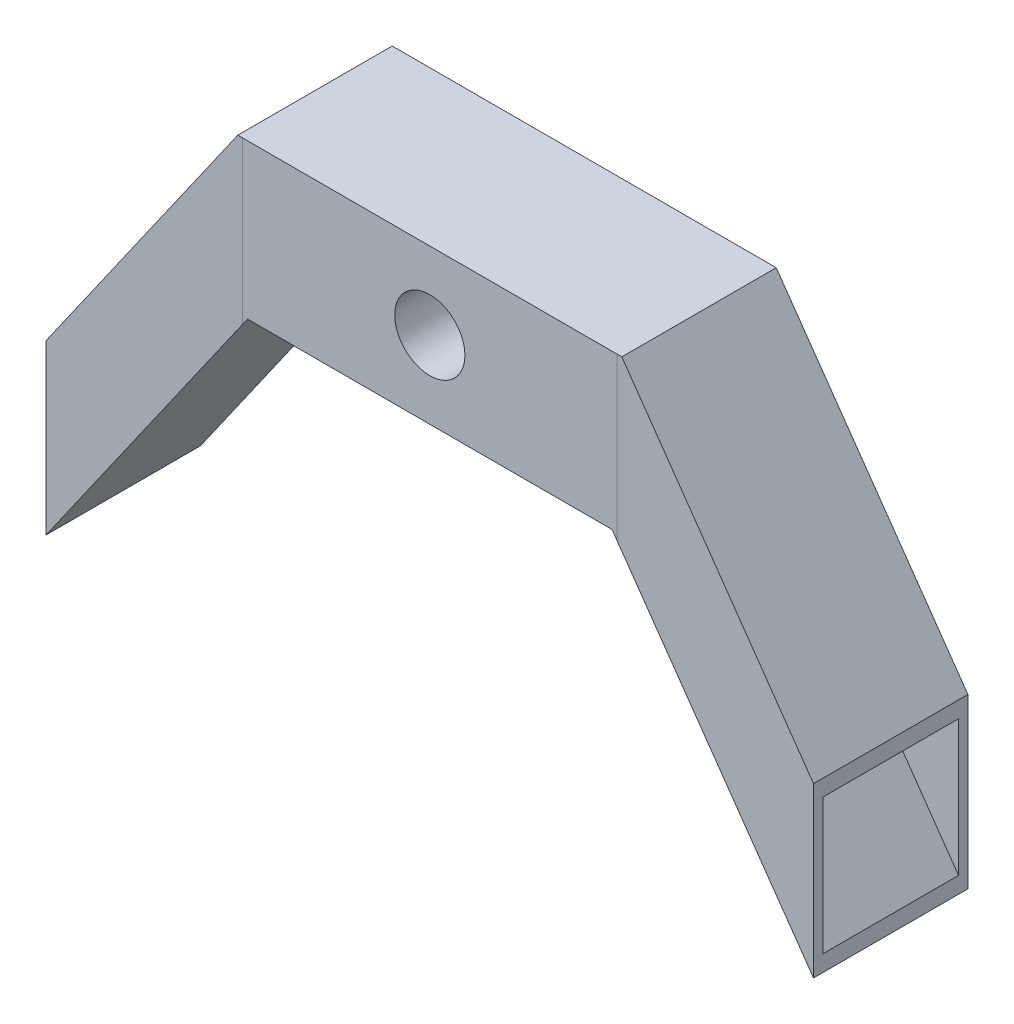
ISO-10303-21;
HEADER;
FILE_DESCRIPTION(('STEP AP214'),'2;1');
FILE_NAME('part.step','',(''),(''),'','','');
FILE_SCHEMA(('AUTOMOTIVE_DESIGN { 1 0 10303 214 1 1 1 1 }'));
ENDSEC;
DATA;
#1=APPLICATION_CONTEXT('core data for automotive mechanical design processes');
#2=APPLICATION_PROTOCOL_DEFINITION('international standard','automotive_design',2000,#1);
#3=PRODUCT_CONTEXT('',#1,'mechanical');
#4=PRODUCT('Part','Part','',(#3));
#5=PRODUCT_RELATED_PRODUCT_CATEGORY('part','',(#4));
#6=PRODUCT_DEFINITION_FORMATION('','',#4);
#7=PRODUCT_DEFINITION_CONTEXT('part definition',#1,'design');
#8=PRODUCT_DEFINITION('design','',#6,#7);
#9=PRODUCT_DEFINITION_SHAPE('','',#8);
#10=(LENGTH_UNIT() NAMED_UNIT(*) SI_UNIT(.MILLI.,.METRE.));
#11=(NAMED_UNIT(*) PLANE_ANGLE_UNIT() SI_UNIT($,.RADIAN.));
#12=(NAMED_UNIT(*) SI_UNIT($,.STERADIAN.) SOLID_ANGLE_UNIT());
#13=UNCERTAINTY_MEASURE_WITH_UNIT(LENGTH_MEASURE(1.E-05),#10,'distance_accuracy_value','');
#14=(GEOMETRIC_REPRESENTATION_CONTEXT(3) GLOBAL_UNCERTAINTY_ASSIGNED_CONTEXT((#13)) GLOBAL_UNIT_ASSIGNED_CONTEXT((#10,
#11,#12)) REPRESENTATION_CONTEXT('',''));
#15=CARTESIAN_POINT('',(0.,0.,0.));
#16=DIRECTION('',(0.,0.,1.));
#17=DIRECTION('',(1.,0.,0.));
#18=AXIS2_PLACEMENT_3D('',#15,#16,#17);
#19=CARTESIAN_POINT('',(42.0124522925823,45.5,-14.5));
#20=DIRECTION('',(0.,0.,-1.));
#21=DIRECTION('',(-1.,0.,0.));
#22=AXIS2_PLACEMENT_3D('',#19,#20,#21);
#23=PLANE('',#22);
#24=DIRECTION('',(0.,1.,0.));
#25=VECTOR('',#24,1.);
#26=CARTESIAN_POINT('',(97.0124522925823,45.5,-14.5));
#27=LINE('',#26,#25);
#28=CARTESIAN_POINT('',(97.0124522925823,45.5,-14.5));
#29=VERTEX_POINT('',#28);
#30=CARTESIAN_POINT('',(97.0124522925823,74.5,-14.5));
#31=VERTEX_POINT('',#30);
#32=EDGE_CURVE('E396',#29,#31,#27,.T.);
#33=ORIENTED_EDGE('',*,*,#32,.F.);
#34=DIRECTION('',(1.,0.,0.));
#35=VECTOR('',#34,1.);
#36=CARTESIAN_POINT('',(42.0124522925823,45.5,-14.5));
#37=LINE('',#36,#35);
#38=CARTESIAN_POINT('',(122.012452292582,45.5,-14.5));
#39=VERTEX_POINT('',#38);
#40=EDGE_CURVE('E375',#29,#39,#37,.T.);
#41=ORIENTED_EDGE('',*,*,#40,.T.);
#42=DIRECTION('',(0.,1.,0.));
#43=VECTOR('',#42,1.);
#44=CARTESIAN_POINT('',(122.012452292582,45.5,-14.5));
#45=LINE('',#44,#43);
#46=CARTESIAN_POINT('',(122.012452292582,74.5,-14.5));
#47=VERTEX_POINT('',#46);
#48=EDGE_CURVE('E421',#39,#47,#45,.T.);
#49=ORIENTED_EDGE('',*,*,#48,.T.);
#50=DIRECTION('',(1.,0.,0.));
#51=VECTOR('',#50,1.);
#52=CARTESIAN_POINT('',(42.0124522925823,74.5,-14.5));
#53=LINE('',#52,#51);
#54=EDGE_CURVE('E424',#31,#47,#53,.T.);
#55=ORIENTED_EDGE('',*,*,#54,.F.);
#56=EDGE_LOOP('',(#33,#41,#49,#55));
#57=FACE_BOUND('',#56,.T.);
#58=ADVANCED_FACE('F45',(#57),#23,.F.);
#59=DIRECTION('',(0.,-1.,0.));
#60=VECTOR('',#59,1.);
#61=CARTESIAN_POINT('',(67.0124522925823,45.5,-14.5));
#62=LINE('',#61,#60);
#63=CARTESIAN_POINT('',(67.0124522925823,74.5,-14.5));
#64=VERTEX_POINT('',#63);
#65=CARTESIAN_POINT('',(67.0124522925823,45.5,-14.5));
#66=VERTEX_POINT('',#65);
#67=EDGE_CURVE('E69',#64,#66,#62,.T.);
#68=ORIENTED_EDGE('',*,*,#67,.F.);
#69=CARTESIAN_POINT('',(42.0124522925824,74.5,-14.5));
#70=VERTEX_POINT('',#69);
#71=EDGE_CURVE('E417',#70,#64,#53,.T.);
#72=ORIENTED_EDGE('',*,*,#71,.F.);
#73=DIRECTION('',(0.,1.,0.));
#74=VECTOR('',#73,1.);
#75=CARTESIAN_POINT('',(42.0124522925824,45.5,-14.5));
#76=LINE('',#75,#74);
#77=CARTESIAN_POINT('',(42.0124522925824,45.5,-14.5));
#78=VERTEX_POINT('',#77);
#79=EDGE_CURVE('E460',#78,#70,#76,.T.);
#80=ORIENTED_EDGE('',*,*,#79,.F.);
#81=EDGE_CURVE('E418',#78,#66,#37,.T.);
#82=ORIENTED_EDGE('',*,*,#81,.T.);
#83=EDGE_LOOP('',(#68,#72,#80,#82));
#84=FACE_BOUND('',#83,.T.);
#85=ADVANCED_FACE('F591',(#84),#23,.F.);
#86=CARTESIAN_POINT('',(42.0124522925823,74.5,14.5));
#87=DIRECTION('',(0.,1.,0.));
#88=DIRECTION('',(-1.,0.,0.));
#89=AXIS2_PLACEMENT_3D('',#86,#87,#88);
#90=PLANE('',#89);
#91=DIRECTION('',(0.,0.,1.));
#92=VECTOR('',#91,1.);
#93=CARTESIAN_POINT('',(97.0124522925823,74.5,14.5));
#94=LINE('',#93,#92);
#95=CARTESIAN_POINT('',(97.0124522925823,74.5,14.5));
#96=VERTEX_POINT('',#95);
#97=EDGE_CURVE('E61',#31,#96,#94,.T.);
#98=ORIENTED_EDGE('',*,*,#97,.F.);
#99=ORIENTED_EDGE('',*,*,#54,.T.);
#100=DIRECTION('',(0.,0.,1.));
#101=VECTOR('',#100,1.);
#102=CARTESIAN_POINT('',(122.012452292582,74.5,14.5));
#103=LINE('',#102,#101);
#104=CARTESIAN_POINT('',(122.012452292582,74.5,14.5));
#105=VERTEX_POINT('',#104);
#106=EDGE_CURVE('E413',#47,#105,#103,.T.);
#107=ORIENTED_EDGE('',*,*,#106,.T.);
#108=DIRECTION('',(1.,0.,0.));
#109=VECTOR('',#108,1.);
#110=CARTESIAN_POINT('',(42.0124522925823,74.5,14.5));
#111=LINE('',#110,#109);
#112=EDGE_CURVE('E412',#96,#105,#111,.T.);
#113=ORIENTED_EDGE('',*,*,#112,.F.);
#114=EDGE_LOOP('',(#98,#99,#107,#113));
#115=FACE_BOUND('',#114,.T.);
#116=ADVANCED_FACE('F558',(#115),#90,.F.);
#117=DIRECTION('',(0.,0.,-1.));
#118=VECTOR('',#117,1.);
#119=CARTESIAN_POINT('',(67.0124522925823,74.5,14.5));
#120=LINE('',#119,#118);
#121=CARTESIAN_POINT('',(67.0124522925823,74.5,14.5));
#122=VERTEX_POINT('',#121);
#123=EDGE_CURVE('E232',#122,#64,#120,.T.);
#124=ORIENTED_EDGE('',*,*,#123,.F.);
#125=CARTESIAN_POINT('',(42.0124522925824,74.5,14.5));
#126=VERTEX_POINT('',#125);
#127=EDGE_CURVE('E228',#126,#122,#111,.T.);
#128=ORIENTED_EDGE('',*,*,#127,.F.);
#129=DIRECTION('',(0.,0.,1.));
#130=VECTOR('',#129,1.);
#131=CARTESIAN_POINT('',(42.0124522925824,74.5,14.5));
#132=LINE('',#131,#130);
#133=EDGE_CURVE('E450',#70,#126,#132,.T.);
#134=ORIENTED_EDGE('',*,*,#133,.F.);
#135=ORIENTED_EDGE('',*,*,#71,.T.);
#136=EDGE_LOOP('',(#124,#128,#134,#135));
#137=FACE_BOUND('',#136,.T.);
#138=ADVANCED_FACE('F602',(#137),#90,.F.);
#139=CARTESIAN_POINT('',(42.0124522925823,45.5,14.5));
#140=DIRECTION('',(0.,0.,1.));
#141=DIRECTION('',(1.,0.,0.));
#142=AXIS2_PLACEMENT_3D('',#139,#140,#141);
#143=PLANE('',#142);
#144=DIRECTION('',(0.,-1.,0.));
#145=VECTOR('',#144,1.);
#146=CARTESIAN_POINT('',(97.0124522925823,45.5,14.5));
#147=LINE('',#146,#145);
#148=CARTESIAN_POINT('',(97.0124522925823,45.5,14.5));
#149=VERTEX_POINT('',#148);
#150=EDGE_CURVE('E474',#96,#149,#147,.T.);
#151=ORIENTED_EDGE('',*,*,#150,.F.);
#152=ORIENTED_EDGE('',*,*,#112,.T.);
#153=DIRECTION('',(0.,-1.,0.));
#154=VECTOR('',#153,1.);
#155=CARTESIAN_POINT('',(122.012452292582,45.5,14.5));
#156=LINE('',#155,#154);
#157=CARTESIAN_POINT('',(122.012452292582,45.5,14.5));
#158=VERTEX_POINT('',#157);
#159=EDGE_CURVE('E406',#105,#158,#156,.T.);
#160=ORIENTED_EDGE('',*,*,#159,.T.);
#161=DIRECTION('',(1.,0.,0.));
#162=VECTOR('',#161,1.);
#163=CARTESIAN_POINT('',(42.0124522925823,45.5,14.5));
#164=LINE('',#163,#162);
#165=EDGE_CURVE('E221',#149,#158,#164,.T.);
#166=ORIENTED_EDGE('',*,*,#165,.F.);
#167=EDGE_LOOP('',(#151,#152,#160,#166));
#168=FACE_BOUND('',#167,.T.);
#169=ADVANCED_FACE('F573',(#168),#143,.F.);
#170=DIRECTION('',(0.,1.,0.));
#171=VECTOR('',#170,1.);
#172=CARTESIAN_POINT('',(67.0124522925823,45.5,14.5));
#173=LINE('',#172,#171);
#174=CARTESIAN_POINT('',(67.0124522925823,45.5,14.5));
#175=VERTEX_POINT('',#174);
#176=EDGE_CURVE('E225',#175,#122,#173,.T.);
#177=ORIENTED_EDGE('',*,*,#176,.F.);
#178=CARTESIAN_POINT('',(42.0124522925824,45.5,14.5));
#179=VERTEX_POINT('',#178);
#180=EDGE_CURVE('E210',#179,#175,#164,.T.);
#181=ORIENTED_EDGE('',*,*,#180,.F.);
#182=DIRECTION('',(0.,-1.,0.));
#183=VECTOR('',#182,1.);
#184=CARTESIAN_POINT('',(42.0124522925824,45.5,14.5));
#185=LINE('',#184,#183);
#186=EDGE_CURVE('E439',#126,#179,#185,.T.);
#187=ORIENTED_EDGE('',*,*,#186,.F.);
#188=ORIENTED_EDGE('',*,*,#127,.T.);
#189=EDGE_LOOP('',(#177,#181,#187,#188));
#190=FACE_BOUND('',#189,.T.);
#191=ADVANCED_FACE('F226',(#190),#143,.F.);
#192=CARTESIAN_POINT('',(42.0124522925823,45.5,14.5));
#193=DIRECTION('',(0.,-1.,0.));
#194=DIRECTION('',(1.,0.,0.));
#195=AXIS2_PLACEMENT_3D('',#192,#193,#194);
#196=PLANE('',#195);
#197=DIRECTION('',(0.,0.,-1.));
#198=VECTOR('',#197,1.);
#199=CARTESIAN_POINT('',(97.0124522925823,45.5,14.5));
#200=LINE('',#199,#198);
#201=EDGE_CURVE('E11',#149,#29,#200,.T.);
#202=ORIENTED_EDGE('',*,*,#201,.F.);
#203=ORIENTED_EDGE('',*,*,#165,.T.);
#204=DIRECTION('',(0.,0.,-1.));
#205=VECTOR('',#204,1.);
#206=CARTESIAN_POINT('',(122.012452292582,45.5,14.5));
#207=LINE('',#206,#205);
#208=EDGE_CURVE('E220',#158,#39,#207,.T.);
#209=ORIENTED_EDGE('',*,*,#208,.T.);
#210=ORIENTED_EDGE('',*,*,#40,.F.);
#211=EDGE_LOOP('',(#202,#203,#209,#210));
#212=FACE_BOUND('',#211,.T.);
#213=ADVANCED_FACE('F565',(#212),#196,.F.);
#214=DIRECTION('',(0.,0.,1.));
#215=VECTOR('',#214,1.);
#216=CARTESIAN_POINT('',(67.0124522925823,45.5,14.5));
#217=LINE('',#216,#215);
#218=EDGE_CURVE('E54',#66,#175,#217,.T.);
#219=ORIENTED_EDGE('',*,*,#218,.F.);
#220=ORIENTED_EDGE('',*,*,#81,.F.);
#221=DIRECTION('',(0.,0.,-1.));
#222=VECTOR('',#221,1.);
#223=CARTESIAN_POINT('',(42.0124522925824,45.5,14.5));
#224=LINE('',#223,#222);
#225=EDGE_CURVE('E215',#179,#78,#224,.T.);
#226=ORIENTED_EDGE('',*,*,#225,.F.);
#227=ORIENTED_EDGE('',*,*,#180,.T.);
#228=EDGE_LOOP('',(#219,#220,#226,#227));
#229=FACE_BOUND('',#228,.T.);
#230=ADVANCED_FACE('F212',(#229),#196,.F.);
#231=CARTESIAN_POINT('',(164.024904585165,0.,0.));
#232=DIRECTION('',(-1.,0.,0.));
#233=DIRECTION('',(0.,0.,1.));
#234=AXIS2_PLACEMENT_3D('',#231,#232,#233);
#235=PLANE('',#234);
#236=DIRECTION('',(0.,1.,0.));
#237=VECTOR('',#236,1.);
#238=CARTESIAN_POINT('',(164.024904585165,45.5,-16.5));
#239=LINE('',#238,#237);
#240=CARTESIAN_POINT('',(164.024904585165,-17.9868935912422,-16.5));
#241=VERTEX_POINT('',#240);
#242=CARTESIAN_POINT('',(164.024904585165,17.9868935912422,-16.5));
#243=VERTEX_POINT('',#242);
#244=EDGE_CURVE('E274',#241,#243,#239,.T.);
#245=ORIENTED_EDGE('',*,*,#244,.T.);
#246=DIRECTION('',(0.,0.,1.));
#247=VECTOR('',#246,1.);
#248=CARTESIAN_POINT('',(164.024904585165,17.9868935912422,14.5));
#249=LINE('',#248,#247);
#250=CARTESIAN_POINT('',(164.024904585165,17.9868935912422,16.5));
#251=VERTEX_POINT('',#250);
#252=EDGE_CURVE('E270',#243,#251,#249,.T.);
#253=ORIENTED_EDGE('',*,*,#252,.T.);
#254=DIRECTION('',(0.,-1.,0.));
#255=VECTOR('',#254,1.);
#256=CARTESIAN_POINT('',(164.024904585165,45.5,16.5));
#257=LINE('',#256,#255);
#258=CARTESIAN_POINT('',(164.024904585165,-17.9868935912422,16.5));
#259=VERTEX_POINT('',#258);
#260=EDGE_CURVE('E266',#251,#259,#257,.T.);
#261=ORIENTED_EDGE('',*,*,#260,.T.);
#262=DIRECTION('',(0.,0.,-1.));
#263=VECTOR('',#262,1.);
#264=CARTESIAN_POINT('',(164.024904585165,-17.9868935912422,14.5));
#265=LINE('',#264,#263);
#266=EDGE_CURVE('E261',#259,#241,#265,.T.);
#267=ORIENTED_EDGE('',*,*,#266,.T.);
#268=EDGE_LOOP('',(#245,#253,#261,#267));
#269=FACE_BOUND('',#268,.T.);
#270=DIRECTION('',(0.,1.,0.));
#271=VECTOR('',#270,1.);
#272=CARTESIAN_POINT('',(164.024904585165,-14.5,-14.5));
#273=LINE('',#272,#271);
#274=CARTESIAN_POINT('',(164.024904585165,-14.5,-14.5));
#275=VERTEX_POINT('',#274);
#276=CARTESIAN_POINT('',(164.024904585165,14.5,-14.5));
#277=VERTEX_POINT('',#276);
#278=EDGE_CURVE('E395',#275,#277,#273,.T.);
#279=ORIENTED_EDGE('',*,*,#278,.F.);
#280=DIRECTION('',(0.,0.,-1.));
#281=VECTOR('',#280,1.);
#282=CARTESIAN_POINT('',(164.024904585165,-14.5,14.5));
#283=LINE('',#282,#281);
#284=CARTESIAN_POINT('',(164.024904585165,-14.5,14.5));
#285=VERTEX_POINT('',#284);
#286=EDGE_CURVE('E372',#285,#275,#283,.T.);
#287=ORIENTED_EDGE('',*,*,#286,.F.);
#288=DIRECTION('',(0.,-1.,0.));
#289=VECTOR('',#288,1.);
#290=CARTESIAN_POINT('',(164.024904585165,-14.5,14.5));
#291=LINE('',#290,#289);
#292=CARTESIAN_POINT('',(164.024904585165,14.5,14.5));
#293=VERTEX_POINT('',#292);
#294=EDGE_CURVE('E379',#293,#285,#291,.T.);
#295=ORIENTED_EDGE('',*,*,#294,.F.);
#296=DIRECTION('',(0.,0.,1.));
#297=VECTOR('',#296,1.);
#298=CARTESIAN_POINT('',(164.024904585165,14.5,14.5));
#299=LINE('',#298,#297);
#300=EDGE_CURVE('E387',#277,#293,#299,.T.);
#301=ORIENTED_EDGE('',*,*,#300,.F.);
#302=EDGE_LOOP('',(#279,#287,#295,#301));
#303=FACE_BOUND('',#302,.T.);
#304=ADVANCED_FACE('F539',(#269,#303),#235,.F.);
#305=CARTESIAN_POINT('',(0.,0.,0.));
#306=DIRECTION('',(-1.,0.,0.));
#307=DIRECTION('',(0.,0.,1.));
#308=AXIS2_PLACEMENT_3D('',#305,#306,#307);
#309=PLANE('',#308);
#310=DIRECTION('',(0.,1.,0.));
#311=VECTOR('',#310,1.);
#312=CARTESIAN_POINT('',(0.,-14.5,-16.5));
#313=LINE('',#312,#311);
#314=CARTESIAN_POINT('',(0.,-17.9868935912422,-16.5));
#315=VERTEX_POINT('',#314);
#316=CARTESIAN_POINT('',(0.,17.9868935912422,-16.5));
#317=VERTEX_POINT('',#316);
#318=EDGE_CURVE('E248',#315,#317,#313,.T.);
#319=ORIENTED_EDGE('',*,*,#318,.F.);
#320=DIRECTION('',(0.,0.,-1.));
#321=VECTOR('',#320,1.);
#322=CARTESIAN_POINT('',(0.,-17.9868935912422,14.5));
#323=LINE('',#322,#321);
#324=CARTESIAN_POINT('',(0.,-17.9868935912422,16.5));
#325=VERTEX_POINT('',#324);
#326=EDGE_CURVE('E252',#325,#315,#323,.T.);
#327=ORIENTED_EDGE('',*,*,#326,.F.);
#328=DIRECTION('',(0.,-1.,0.));
#329=VECTOR('',#328,1.);
#330=CARTESIAN_POINT('',(0.,-14.5,16.5));
#331=LINE('',#330,#329);
#332=CARTESIAN_POINT('',(0.,17.9868935912422,16.5));
#333=VERTEX_POINT('',#332);
#334=EDGE_CURVE('E247',#333,#325,#331,.T.);
#335=ORIENTED_EDGE('',*,*,#334,.F.);
#336=DIRECTION('',(0.,0.,1.));
#337=VECTOR('',#336,1.);
#338=CARTESIAN_POINT('',(0.,17.9868935912422,14.5));
#339=LINE('',#338,#337);
#340=EDGE_CURVE('E243',#317,#333,#339,.T.);
#341=ORIENTED_EDGE('',*,*,#340,.F.);
#342=EDGE_LOOP('',(#319,#327,#335,#341));
#343=FACE_BOUND('',#342,.T.);
#344=DIRECTION('',(0.,0.,-1.));
#345=VECTOR('',#344,1.);
#346=CARTESIAN_POINT('',(0.,-14.5,14.5));
#347=LINE('',#346,#345);
#348=CARTESIAN_POINT('',(0.,-14.5,14.5));
#349=VERTEX_POINT('',#348);
#350=CARTESIAN_POINT('',(0.,-14.5,-14.5));
#351=VERTEX_POINT('',#350);
#352=EDGE_CURVE('E431',#349,#351,#347,.T.);
#353=ORIENTED_EDGE('',*,*,#352,.T.);
#354=DIRECTION('',(0.,1.,0.));
#355=VECTOR('',#354,1.);
#356=CARTESIAN_POINT('',(0.,-14.5,-14.5));
#357=LINE('',#356,#355);
#358=CARTESIAN_POINT('',(0.,14.5,-14.5));
#359=VERTEX_POINT('',#358);
#360=EDGE_CURVE('E404',#351,#359,#357,.T.);
#361=ORIENTED_EDGE('',*,*,#360,.T.);
#362=DIRECTION('',(0.,0.,1.));
#363=VECTOR('',#362,1.);
#364=CARTESIAN_POINT('',(0.,14.5,14.5));
#365=LINE('',#364,#363);
#366=CARTESIAN_POINT('',(0.,14.5,14.5));
#367=VERTEX_POINT('',#366);
#368=EDGE_CURVE('E446',#359,#367,#365,.T.);
#369=ORIENTED_EDGE('',*,*,#368,.T.);
#370=DIRECTION('',(0.,-1.,0.));
#371=VECTOR('',#370,1.);
#372=CARTESIAN_POINT('',(0.,-14.5,14.5));
#373=LINE('',#372,#371);
#374=EDGE_CURVE('E436',#367,#349,#373,.T.);
#375=ORIENTED_EDGE('',*,*,#374,.T.);
#376=EDGE_LOOP('',(#353,#361,#369,#375));
#377=FACE_BOUND('',#376,.T.);
#378=ADVANCED_FACE('F542',(#343,#377),#309,.T.);
#379=CARTESIAN_POINT('',(122.012452292582,45.5,-16.5));
#380=DIRECTION('',(0.,0.,-1.));
#381=DIRECTION('',(-1.,0.,0.));
#382=AXIS2_PLACEMENT_3D('',#379,#380,#381);
#383=PLANE('',#382);
#384=DIRECTION('',(0.573576436351044,-0.819152044288993,0.));
#385=VECTOR('',#384,1.);
#386=CARTESIAN_POINT('',(137.276299382556,56.1878607944798,-16.5));
#387=LINE('',#386,#385);
#388=CARTESIAN_POINT('',(123.053586393686,76.5,-16.5));
#389=VERTEX_POINT('',#388);
#390=EDGE_CURVE('E273',#389,#243,#387,.T.);
#391=ORIENTED_EDGE('',*,*,#390,.T.);
#392=ORIENTED_EDGE('',*,*,#244,.F.);
#393=DIRECTION('',(0.573576436351044,-0.819152044288993,0.));
#394=VECTOR('',#393,1.);
#395=CARTESIAN_POINT('',(120.374148204004,44.3528471272979,-16.5));
#396=LINE('',#395,#394);
#397=CARTESIAN_POINT('',(122.012452292582,42.0131064087578,-16.5));
#398=VERTEX_POINT('',#397);
#399=EDGE_CURVE('E276',#398,#241,#396,.T.);
#400=ORIENTED_EDGE('',*,*,#399,.F.);
#401=DIRECTION('',(0.,1.,0.));
#402=VECTOR('',#401,1.);
#403=CARTESIAN_POINT('',(122.012452292582,45.5,-16.5));
#404=LINE('',#403,#402);
#405=CARTESIAN_POINT('',(122.012452292582,76.5,-16.5));
#406=VERTEX_POINT('',#405);
#407=EDGE_CURVE('E344',#398,#406,#404,.T.);
#408=ORIENTED_EDGE('',*,*,#407,.T.);
#409=DIRECTION('',(-1.,0.,0.));
#410=VECTOR('',#409,1.);
#411=CARTESIAN_POINT('',(42.0124522925823,76.5,-16.5));
#412=LINE('',#411,#410);
#413=EDGE_CURVE('E301',#389,#406,#412,.T.);
#414=ORIENTED_EDGE('',*,*,#413,.F.);
#415=EDGE_LOOP('',(#391,#392,#400,#408,#414));
#416=FACE_BOUND('',#415,.T.);
#417=ADVANCED_FACE('F533',(#416),#383,.T.);
#418=CARTESIAN_POINT('',(123.65075638116,75.6471528727021,14.5));
#419=DIRECTION('',(0.819152044288993,0.573576436351044,0.));
#420=DIRECTION('',(-0.573576436351044,0.819152044288993,0.));
#421=AXIS2_PLACEMENT_3D('',#418,#419,#420);
#422=PLANE('',#421);
#423=DIRECTION('',(0.573576436351044,-0.819152044288993,0.));
#424=VECTOR('',#423,1.);
#425=CARTESIAN_POINT('',(123.65075638116,75.6471528727021,16.5));
#426=LINE('',#425,#424);
#427=CARTESIAN_POINT('',(123.053586393686,76.5,16.5));
#428=VERTEX_POINT('',#427);
#429=EDGE_CURVE('E269',#428,#251,#426,.T.);
#430=ORIENTED_EDGE('',*,*,#429,.T.);
#431=ORIENTED_EDGE('',*,*,#252,.F.);
#432=ORIENTED_EDGE('',*,*,#390,.F.);
#433=DIRECTION('',(0.,0.,1.));
#434=VECTOR('',#433,1.);
#435=CARTESIAN_POINT('',(123.053586393686,76.5,14.5));
#436=LINE('',#435,#434);
#437=EDGE_CURVE('E337',#389,#428,#436,.T.);
#438=ORIENTED_EDGE('',*,*,#437,.T.);
#439=EDGE_LOOP('',(#430,#431,#432,#438));
#440=FACE_BOUND('',#439,.T.);
#441=ADVANCED_FACE('F537',(#440),#422,.T.);
#442=CARTESIAN_POINT('',(122.012452292582,45.5,16.5));
#443=DIRECTION('',(0.,0.,1.));
#444=DIRECTION('',(1.,0.,0.));
#445=AXIS2_PLACEMENT_3D('',#442,#443,#444);
#446=PLANE('',#445);
#447=DIRECTION('',(0.573576436351044,-0.819152044288993,0.));
#448=VECTOR('',#447,1.);
#449=CARTESIAN_POINT('',(120.374148204004,44.3528471272979,16.5));
#450=LINE('',#449,#448);
#451=CARTESIAN_POINT('',(122.012452292582,42.0131064087578,16.5));
#452=VERTEX_POINT('',#451);
#453=EDGE_CURVE('E265',#452,#259,#450,.T.);
#454=ORIENTED_EDGE('',*,*,#453,.T.);
#455=ORIENTED_EDGE('',*,*,#260,.F.);
#456=ORIENTED_EDGE('',*,*,#429,.F.);
#457=DIRECTION('',(-1.,0.,0.));
#458=VECTOR('',#457,1.);
#459=CARTESIAN_POINT('',(122.012452292582,76.5,16.5));
#460=LINE('',#459,#458);
#461=CARTESIAN_POINT('',(122.012452292582,76.5,16.5));
#462=VERTEX_POINT('',#461);
#463=EDGE_CURVE('E293',#428,#462,#460,.T.);
#464=ORIENTED_EDGE('',*,*,#463,.T.);
#465=DIRECTION('',(0.,1.,0.));
#466=VECTOR('',#465,1.);
#467=CARTESIAN_POINT('',(122.012452292582,45.5,16.5));
#468=LINE('',#467,#466);
#469=EDGE_CURVE('E331',#462,#452,#468,.F.);
#470=ORIENTED_EDGE('',*,*,#469,.T.);
#471=EDGE_LOOP('',(#454,#455,#456,#464,#470));
#472=FACE_BOUND('',#471,.T.);
#473=ADVANCED_FACE('F517',(#472),#446,.T.);
#474=CARTESIAN_POINT('',(120.374148204004,44.3528471272979,14.5));
#475=DIRECTION('',(-0.819152044288993,-0.573576436351044,0.));
#476=DIRECTION('',(0.573576436351044,-0.819152044288993,0.));
#477=AXIS2_PLACEMENT_3D('',#474,#475,#476);
#478=PLANE('',#477);
#479=ORIENTED_EDGE('',*,*,#266,.F.);
#480=ORIENTED_EDGE('',*,*,#453,.F.);
#481=DIRECTION('',(0.573576436351044,-0.819152044288993,0.));
#482=VECTOR('',#481,1.);
#483=CARTESIAN_POINT('',(94.0549539370313,81.9405519587342,16.5));
#484=LINE('',#483,#482);
#485=CARTESIAN_POINT('',(120.971318191479,43.5,16.5));
#486=VERTEX_POINT('',#485);
#487=EDGE_CURVE('E289',#486,#452,#484,.T.);
#488=ORIENTED_EDGE('',*,*,#487,.F.);
#489=DIRECTION('',(0.,0.,-1.));
#490=VECTOR('',#489,1.);
#491=CARTESIAN_POINT('',(120.971318191479,43.5,14.5));
#492=LINE('',#491,#490);
#493=CARTESIAN_POINT('',(120.971318191479,43.5,-16.5));
#494=VERTEX_POINT('',#493);
#495=EDGE_CURVE('E260',#486,#494,#492,.T.);
#496=ORIENTED_EDGE('',*,*,#495,.T.);
#497=DIRECTION('',(0.573576436351044,-0.819152044288993,0.));
#498=VECTOR('',#497,1.);
#499=CARTESIAN_POINT('',(120.374148204004,44.3528471272979,-16.5));
#500=LINE('',#499,#498);
#501=EDGE_CURVE('E297',#494,#398,#500,.T.);
#502=ORIENTED_EDGE('',*,*,#501,.T.);
#503=ORIENTED_EDGE('',*,*,#399,.T.);
#504=EDGE_LOOP('',(#479,#480,#488,#496,#502,#503));
#505=FACE_BOUND('',#504,.T.);
#506=ADVANCED_FACE('F514',(#505),#478,.T.);
#507=CARTESIAN_POINT('',(42.0124522925823,45.5,-16.5));
#508=DIRECTION('',(0.,0.,-1.));
#509=DIRECTION('',(-1.,0.,0.));
#510=AXIS2_PLACEMENT_3D('',#507,#508,#509);
#511=PLANE('',#510);
#512=CARTESIAN_POINT('',(82.0124522925823,59.9999999999973,-16.5));
#513=DIRECTION('',(0.,0.,1.));
#514=DIRECTION('',(1.,0.,0.));
#515=AXIS2_PLACEMENT_3D('',#512,#513,#514);
#516=CIRCLE('',#515,7.50000000000001);
#517=CARTESIAN_POINT('',(89.5124522925824,59.9999999999973,-16.5));
#518=VERTEX_POINT('',#517);
#519=EDGE_CURVE('E233',#518,#518,#516,.T.);
#520=ORIENTED_EDGE('',*,*,#519,.T.);
#521=EDGE_LOOP('',(#520));
#522=FACE_BOUND('',#521,.T.);
#523=DIRECTION('',(1.,0.,0.));
#524=VECTOR('',#523,1.);
#525=CARTESIAN_POINT('',(42.0124522925823,76.5,-16.5));
#526=LINE('',#525,#524);
#527=CARTESIAN_POINT('',(42.0124522925824,76.5,-16.5));
#528=VERTEX_POINT('',#527);
#529=EDGE_CURVE('E345',#528,#406,#526,.T.);
#530=ORIENTED_EDGE('',*,*,#529,.T.);
#531=ORIENTED_EDGE('',*,*,#407,.F.);
#532=ORIENTED_EDGE('',*,*,#501,.F.);
#533=DIRECTION('',(1.,0.,0.));
#534=VECTOR('',#533,1.);
#535=CARTESIAN_POINT('',(42.0124522925823,43.5,-16.5));
#536=LINE('',#535,#534);
#537=CARTESIAN_POINT('',(43.0535863936858,43.5,-16.5));
#538=VERTEX_POINT('',#537);
#539=EDGE_CURVE('E264',#538,#494,#536,.T.);
#540=ORIENTED_EDGE('',*,*,#539,.F.);
#541=DIRECTION('',(-0.573576436351044,-0.819152044288994,0.));
#542=VECTOR('',#541,1.);
#543=CARTESIAN_POINT('',(43.6507563811603,44.3528471272979,-16.5));
#544=LINE('',#543,#542);
#545=CARTESIAN_POINT('',(42.0124522925824,42.0131064087578,-16.5));
#546=VERTEX_POINT('',#545);
#547=EDGE_CURVE('E281',#538,#546,#544,.T.);
#548=ORIENTED_EDGE('',*,*,#547,.T.);
#549=DIRECTION('',(0.,1.,0.));
#550=VECTOR('',#549,1.);
#551=CARTESIAN_POINT('',(42.0124522925824,45.5,-16.5));
#552=LINE('',#551,#550);
#553=EDGE_CURVE('E318',#546,#528,#552,.T.);
#554=ORIENTED_EDGE('',*,*,#553,.T.);
#555=EDGE_LOOP('',(#530,#531,#532,#540,#548,#554));
#556=FACE_BOUND('',#555,.T.);
#557=ADVANCED_FACE('F509',(#522,#556),#511,.T.);
#558=CARTESIAN_POINT('',(42.0124522925823,76.5,14.5));
#559=DIRECTION('',(0.,1.,0.));
#560=DIRECTION('',(-1.,0.,0.));
#561=AXIS2_PLACEMENT_3D('',#558,#559,#560);
#562=PLANE('',#561);
#563=DIRECTION('',(1.,0.,0.));
#564=VECTOR('',#563,1.);
#565=CARTESIAN_POINT('',(42.0124522925823,76.5,16.5));
#566=LINE('',#565,#564);
#567=CARTESIAN_POINT('',(42.0124522925824,76.5,16.5));
#568=VERTEX_POINT('',#567);
#569=EDGE_CURVE('E334',#568,#462,#566,.T.);
#570=ORIENTED_EDGE('',*,*,#569,.T.);
#571=ORIENTED_EDGE('',*,*,#463,.F.);
#572=ORIENTED_EDGE('',*,*,#437,.F.);
#573=ORIENTED_EDGE('',*,*,#413,.T.);
#574=ORIENTED_EDGE('',*,*,#529,.F.);
#575=DIRECTION('',(-1.,0.,0.));
#576=VECTOR('',#575,1.);
#577=CARTESIAN_POINT('',(42.0124522925823,76.5,-16.5));
#578=LINE('',#577,#576);
#579=CARTESIAN_POINT('',(40.9713181914788,76.5,-16.5));
#580=VERTEX_POINT('',#579);
#581=EDGE_CURVE('E285',#528,#580,#578,.T.);
#582=ORIENTED_EDGE('',*,*,#581,.T.);
#583=DIRECTION('',(0.,0.,1.));
#584=VECTOR('',#583,1.);
#585=CARTESIAN_POINT('',(40.9713181914789,76.5,14.5));
#586=LINE('',#585,#584);
#587=CARTESIAN_POINT('',(40.9713181914789,76.5,16.5));
#588=VERTEX_POINT('',#587);
#589=EDGE_CURVE('E315',#580,#588,#586,.T.);
#590=ORIENTED_EDGE('',*,*,#589,.T.);
#591=DIRECTION('',(-1.,0.,0.));
#592=VECTOR('',#591,1.);
#593=CARTESIAN_POINT('',(0.,76.5,16.5));
#594=LINE('',#593,#592);
#595=EDGE_CURVE('E240',#568,#588,#594,.T.);
#596=ORIENTED_EDGE('',*,*,#595,.F.);
#597=EDGE_LOOP('',(#570,#571,#572,#573,#574,#582,#590,#596));
#598=FACE_BOUND('',#597,.T.);
#599=ADVANCED_FACE('F496',(#598),#562,.T.);
#600=CARTESIAN_POINT('',(42.0124522925823,45.5,16.5));
#601=DIRECTION('',(0.,0.,1.));
#602=DIRECTION('',(1.,0.,0.));
#603=AXIS2_PLACEMENT_3D('',#600,#601,#602);
#604=PLANE('',#603);
#605=CARTESIAN_POINT('',(82.0124522925823,59.9999999999973,16.5));
#606=DIRECTION('',(0.,0.,1.));
#607=DIRECTION('',(1.,0.,0.));
#608=AXIS2_PLACEMENT_3D('',#605,#606,#607);
#609=CIRCLE('',#608,7.50000000000001);
#610=CARTESIAN_POINT('',(89.5124522925824,59.9999999999973,16.5));
#611=VERTEX_POINT('',#610);
#612=EDGE_CURVE('E485',#611,#611,#609,.T.);
#613=ORIENTED_EDGE('',*,*,#612,.F.);
#614=EDGE_LOOP('',(#613));
#615=FACE_BOUND('',#614,.T.);
#616=DIRECTION('',(1.,0.,0.));
#617=VECTOR('',#616,1.);
#618=CARTESIAN_POINT('',(42.0124522925823,43.5,16.5));
#619=LINE('',#618,#617);
#620=CARTESIAN_POINT('',(43.0535863936858,43.5,16.5));
#621=VERTEX_POINT('',#620);
#622=EDGE_CURVE('E327',#621,#486,#619,.T.);
#623=ORIENTED_EDGE('',*,*,#622,.T.);
#624=ORIENTED_EDGE('',*,*,#487,.T.);
#625=ORIENTED_EDGE('',*,*,#469,.F.);
#626=ORIENTED_EDGE('',*,*,#569,.F.);
#627=DIRECTION('',(0.,1.,0.));
#628=VECTOR('',#627,1.);
#629=CARTESIAN_POINT('',(42.0124522925824,45.5,16.5));
#630=LINE('',#629,#628);
#631=CARTESIAN_POINT('',(42.0124522925824,42.0131064087578,16.5));
#632=VERTEX_POINT('',#631);
#633=EDGE_CURVE('E310',#568,#632,#630,.F.);
#634=ORIENTED_EDGE('',*,*,#633,.T.);
#635=DIRECTION('',(-0.573576436351044,-0.819152044288994,0.));
#636=VECTOR('',#635,1.);
#637=CARTESIAN_POINT('',(1.63830408857799,-15.6471528727021,16.5));
#638=LINE('',#637,#636);
#639=EDGE_CURVE('E237',#621,#632,#638,.T.);
#640=ORIENTED_EDGE('',*,*,#639,.F.);
#641=EDGE_LOOP('',(#623,#624,#625,#626,#634,#640));
#642=FACE_BOUND('',#641,.T.);
#643=ADVANCED_FACE('F492',(#615,#642),#604,.T.);
#644=CARTESIAN_POINT('',(42.0124522925823,43.5,14.5));
#645=DIRECTION('',(0.,-1.,0.));
#646=DIRECTION('',(1.,0.,0.));
#647=AXIS2_PLACEMENT_3D('',#644,#645,#646);
#648=PLANE('',#647);
#649=ORIENTED_EDGE('',*,*,#495,.F.);
#650=ORIENTED_EDGE('',*,*,#622,.F.);
#651=DIRECTION('',(0.,0.,-1.));
#652=VECTOR('',#651,1.);
#653=CARTESIAN_POINT('',(43.0535863936858,43.5,14.5));
#654=LINE('',#653,#652);
#655=EDGE_CURVE('E305',#621,#538,#654,.T.);
#656=ORIENTED_EDGE('',*,*,#655,.T.);
#657=ORIENTED_EDGE('',*,*,#539,.T.);
#658=EDGE_LOOP('',(#649,#650,#656,#657));
#659=FACE_BOUND('',#658,.T.);
#660=ADVANCED_FACE('F495',(#659),#648,.T.);
#661=CARTESIAN_POINT('',(0.,-14.5,-16.5));
#662=DIRECTION('',(0.,0.,-1.));
#663=DIRECTION('',(-1.,0.,0.));
#664=AXIS2_PLACEMENT_3D('',#661,#662,#663);
#665=PLANE('',#664);
#666=DIRECTION('',(0.573576436351044,0.819152044288994,0.));
#667=VECTOR('',#666,1.);
#668=CARTESIAN_POINT('',(-15.2638470899736,-3.81213920552018,-16.5));
#669=LINE('',#668,#667);
#670=EDGE_CURVE('E319',#317,#580,#669,.T.);
#671=ORIENTED_EDGE('',*,*,#670,.T.);
#672=ORIENTED_EDGE('',*,*,#581,.F.);
#673=ORIENTED_EDGE('',*,*,#553,.F.);
#674=DIRECTION('',(0.573576436351044,0.819152044288994,0.));
#675=VECTOR('',#674,1.);
#676=CARTESIAN_POINT('',(1.63830408857799,-15.6471528727021,-16.5));
#677=LINE('',#676,#675);
#678=EDGE_CURVE('E256',#315,#546,#677,.T.);
#679=ORIENTED_EDGE('',*,*,#678,.F.);
#680=ORIENTED_EDGE('',*,*,#318,.T.);
#681=EDGE_LOOP('',(#671,#672,#673,#679,#680));
#682=FACE_BOUND('',#681,.T.);
#683=ADVANCED_FACE('F527',(#682),#665,.T.);
#684=CARTESIAN_POINT('',(-1.63830408857799,15.6471528727021,14.5));
#685=DIRECTION('',(-0.819152044288993,0.573576436351044,0.));
#686=DIRECTION('',(-0.573576436351044,-0.819152044288994,0.));
#687=AXIS2_PLACEMENT_3D('',#684,#685,#686);
#688=PLANE('',#687);
#689=DIRECTION('',(0.573576436351044,0.819152044288994,0.));
#690=VECTOR('',#689,1.);
#691=CARTESIAN_POINT('',(-1.63830408857799,15.6471528727021,16.5));
#692=LINE('',#691,#690);
#693=EDGE_CURVE('E311',#333,#588,#692,.T.);
#694=ORIENTED_EDGE('',*,*,#693,.T.);
#695=ORIENTED_EDGE('',*,*,#589,.F.);
#696=ORIENTED_EDGE('',*,*,#670,.F.);
#697=ORIENTED_EDGE('',*,*,#340,.T.);
#698=EDGE_LOOP('',(#694,#695,#696,#697));
#699=FACE_BOUND('',#698,.T.);
#700=ADVANCED_FACE('F634',(#699),#688,.T.);
#701=CARTESIAN_POINT('',(0.,-14.5,16.5));
#702=DIRECTION('',(0.,0.,1.));
#703=DIRECTION('',(1.,0.,0.));
#704=AXIS2_PLACEMENT_3D('',#701,#702,#703);
#705=PLANE('',#704);
#706=DIRECTION('',(0.573576436351044,0.819152044288994,0.));
#707=VECTOR('',#706,1.);
#708=CARTESIAN_POINT('',(1.63830408857799,-15.6471528727021,16.5));
#709=LINE('',#708,#707);
#710=EDGE_CURVE('E306',#325,#632,#709,.T.);
#711=ORIENTED_EDGE('',*,*,#710,.T.);
#712=ORIENTED_EDGE('',*,*,#633,.F.);
#713=ORIENTED_EDGE('',*,*,#595,.T.);
#714=ORIENTED_EDGE('',*,*,#693,.F.);
#715=ORIENTED_EDGE('',*,*,#334,.T.);
#716=EDGE_LOOP('',(#711,#712,#713,#714,#715));
#717=FACE_BOUND('',#716,.T.);
#718=ADVANCED_FACE('F523',(#717),#705,.T.);
#719=CARTESIAN_POINT('',(1.63830408857799,-15.6471528727021,14.5));
#720=DIRECTION('',(0.819152044288993,-0.573576436351044,0.));
#721=DIRECTION('',(0.573576436351044,0.819152044288994,0.));
#722=AXIS2_PLACEMENT_3D('',#719,#720,#721);
#723=PLANE('',#722);
#724=ORIENTED_EDGE('',*,*,#655,.F.);
#725=ORIENTED_EDGE('',*,*,#639,.T.);
#726=ORIENTED_EDGE('',*,*,#710,.F.);
#727=ORIENTED_EDGE('',*,*,#326,.T.);
#728=ORIENTED_EDGE('',*,*,#678,.T.);
#729=ORIENTED_EDGE('',*,*,#547,.F.);
#730=EDGE_LOOP('',(#724,#725,#726,#727,#728,#729));
#731=FACE_BOUND('',#730,.T.);
#732=ADVANCED_FACE('F47',(#731),#723,.T.);
#733=CARTESIAN_POINT('',(122.012452292582,45.5,-14.5));
#734=DIRECTION('',(0.,0.,-1.));
#735=DIRECTION('',(-1.,0.,0.));
#736=AXIS2_PLACEMENT_3D('',#733,#734,#735);
#737=PLANE('',#736);
#738=DIRECTION('',(0.573576436351044,-0.819152044288993,0.));
#739=VECTOR('',#738,1.);
#740=CARTESIAN_POINT('',(122.012452292582,74.5,-14.5));
#741=LINE('',#740,#739);
#742=EDGE_CURVE('E390',#47,#277,#741,.T.);
#743=ORIENTED_EDGE('',*,*,#742,.F.);
#744=ORIENTED_EDGE('',*,*,#48,.F.);
#745=DIRECTION('',(0.573576436351044,-0.819152044288993,0.));
#746=VECTOR('',#745,1.);
#747=CARTESIAN_POINT('',(122.012452292582,45.5,-14.5));
#748=LINE('',#747,#746);
#749=EDGE_CURVE('E391',#39,#275,#748,.T.);
#750=ORIENTED_EDGE('',*,*,#749,.T.);
#751=ORIENTED_EDGE('',*,*,#278,.T.);
#752=EDGE_LOOP('',(#743,#744,#750,#751));
#753=FACE_BOUND('',#752,.T.);
#754=ADVANCED_FACE('F550',(#753),#737,.F.);
#755=CARTESIAN_POINT('',(122.012452292582,74.5,14.5));
#756=DIRECTION('',(0.819152044288993,0.573576436351044,0.));
#757=DIRECTION('',(-0.573576436351044,0.819152044288993,0.));
#758=AXIS2_PLACEMENT_3D('',#755,#756,#757);
#759=PLANE('',#758);
#760=DIRECTION('',(0.573576436351044,-0.819152044288993,0.));
#761=VECTOR('',#760,1.);
#762=CARTESIAN_POINT('',(122.012452292582,74.5,14.5));
#763=LINE('',#762,#761);
#764=EDGE_CURVE('E383',#105,#293,#763,.T.);
#765=ORIENTED_EDGE('',*,*,#764,.F.);
#766=ORIENTED_EDGE('',*,*,#106,.F.);
#767=ORIENTED_EDGE('',*,*,#742,.T.);
#768=ORIENTED_EDGE('',*,*,#300,.T.);
#769=EDGE_LOOP('',(#765,#766,#767,#768));
#770=FACE_BOUND('',#769,.T.);
#771=ADVANCED_FACE('F556',(#770),#759,.F.);
#772=CARTESIAN_POINT('',(122.012452292582,45.5,14.5));
#773=DIRECTION('',(0.,0.,1.));
#774=DIRECTION('',(1.,0.,0.));
#775=AXIS2_PLACEMENT_3D('',#772,#773,#774);
#776=PLANE('',#775);
#777=DIRECTION('',(0.573576436351044,-0.819152044288993,0.));
#778=VECTOR('',#777,1.);
#779=CARTESIAN_POINT('',(122.012452292582,45.5,14.5));
#780=LINE('',#779,#778);
#781=EDGE_CURVE('E376',#158,#285,#780,.T.);
#782=ORIENTED_EDGE('',*,*,#781,.F.);
#783=ORIENTED_EDGE('',*,*,#159,.F.);
#784=ORIENTED_EDGE('',*,*,#764,.T.);
#785=ORIENTED_EDGE('',*,*,#294,.T.);
#786=EDGE_LOOP('',(#782,#783,#784,#785));
#787=FACE_BOUND('',#786,.T.);
#788=ADVANCED_FACE('F571',(#787),#776,.F.);
#789=CARTESIAN_POINT('',(122.012452292582,45.5,14.5));
#790=DIRECTION('',(-0.819152044288993,-0.573576436351044,0.));
#791=DIRECTION('',(0.573576436351044,-0.819152044288993,0.));
#792=AXIS2_PLACEMENT_3D('',#789,#790,#791);
#793=PLANE('',#792);
#794=ORIENTED_EDGE('',*,*,#286,.T.);
#795=ORIENTED_EDGE('',*,*,#749,.F.);
#796=ORIENTED_EDGE('',*,*,#208,.F.);
#797=ORIENTED_EDGE('',*,*,#781,.T.);
#798=EDGE_LOOP('',(#794,#795,#796,#797));
#799=FACE_BOUND('',#798,.T.);
#800=ADVANCED_FACE('F568',(#799),#793,.F.);
#801=CARTESIAN_POINT('',(0.,-14.5,-14.5));
#802=DIRECTION('',(0.,0.,-1.));
#803=DIRECTION('',(-1.,0.,0.));
#804=AXIS2_PLACEMENT_3D('',#801,#802,#803);
#805=PLANE('',#804);
#806=DIRECTION('',(0.573576436351044,0.819152044288993,0.));
#807=VECTOR('',#806,1.);
#808=CARTESIAN_POINT('',(0.,14.5,-14.5));
#809=LINE('',#808,#807);
#810=EDGE_CURVE('E453',#359,#70,#809,.T.);
#811=ORIENTED_EDGE('',*,*,#810,.F.);
#812=ORIENTED_EDGE('',*,*,#360,.F.);
#813=DIRECTION('',(0.573576436351044,0.819152044288993,0.));
#814=VECTOR('',#813,1.);
#815=CARTESIAN_POINT('',(0.,-14.5,-14.5));
#816=LINE('',#815,#814);
#817=EDGE_CURVE('E435',#351,#78,#816,.T.);
#818=ORIENTED_EDGE('',*,*,#817,.T.);
#819=ORIENTED_EDGE('',*,*,#79,.T.);
#820=EDGE_LOOP('',(#811,#812,#818,#819));
#821=FACE_BOUND('',#820,.T.);
#822=ADVANCED_FACE('F615',(#821),#805,.F.);
#823=CARTESIAN_POINT('',(0.,14.5,14.5));
#824=DIRECTION('',(-0.819152044288993,0.573576436351044,0.));
#825=DIRECTION('',(-0.573576436351044,-0.819152044288994,0.));
#826=AXIS2_PLACEMENT_3D('',#823,#824,#825);
#827=PLANE('',#826);
#828=DIRECTION('',(0.573576436351044,0.819152044288993,0.));
#829=VECTOR('',#828,1.);
#830=CARTESIAN_POINT('',(0.,14.5,14.5));
#831=LINE('',#830,#829);
#832=EDGE_CURVE('E442',#367,#126,#831,.T.);
#833=ORIENTED_EDGE('',*,*,#832,.F.);
#834=ORIENTED_EDGE('',*,*,#368,.F.);
#835=ORIENTED_EDGE('',*,*,#810,.T.);
#836=ORIENTED_EDGE('',*,*,#133,.T.);
#837=EDGE_LOOP('',(#833,#834,#835,#836));
#838=FACE_BOUND('',#837,.T.);
#839=ADVANCED_FACE('F670',(#838),#827,.F.);
#840=CARTESIAN_POINT('',(0.,-14.5,14.5));
#841=DIRECTION('',(0.,0.,1.));
#842=DIRECTION('',(1.,0.,0.));
#843=AXIS2_PLACEMENT_3D('',#840,#841,#842);
#844=PLANE('',#843);
#845=DIRECTION('',(0.573576436351044,0.819152044288993,0.));
#846=VECTOR('',#845,1.);
#847=CARTESIAN_POINT('',(0.,-14.5,14.5));
#848=LINE('',#847,#846);
#849=EDGE_CURVE('E430',#349,#179,#848,.T.);
#850=ORIENTED_EDGE('',*,*,#849,.F.);
#851=ORIENTED_EDGE('',*,*,#374,.F.);
#852=ORIENTED_EDGE('',*,*,#832,.T.);
#853=ORIENTED_EDGE('',*,*,#186,.T.);
#854=EDGE_LOOP('',(#850,#851,#852,#853));
#855=FACE_BOUND('',#854,.T.);
#856=ADVANCED_FACE('F678',(#855),#844,.F.);
#857=CARTESIAN_POINT('',(0.,-14.5,14.5));
#858=DIRECTION('',(0.819152044288993,-0.573576436351044,0.));
#859=DIRECTION('',(0.573576436351044,0.819152044288994,0.));
#860=AXIS2_PLACEMENT_3D('',#857,#858,#859);
#861=PLANE('',#860);
#862=ORIENTED_EDGE('',*,*,#225,.T.);
#863=ORIENTED_EDGE('',*,*,#817,.F.);
#864=ORIENTED_EDGE('',*,*,#352,.F.);
#865=ORIENTED_EDGE('',*,*,#849,.T.);
#866=EDGE_LOOP('',(#862,#863,#864,#865));
#867=FACE_BOUND('',#866,.T.);
#868=ADVANCED_FACE('F587',(#867),#861,.F.);
#869=CARTESIAN_POINT('',(67.0124522925823,43.5,15.5));
#870=DIRECTION('',(1.,0.,0.));
#871=DIRECTION('',(0.,0.,-1.));
#872=AXIS2_PLACEMENT_3D('',#869,#870,#871);
#873=PLANE('',#872);
#874=ORIENTED_EDGE('',*,*,#123,.T.);
#875=ORIENTED_EDGE('',*,*,#67,.T.);
#876=ORIENTED_EDGE('',*,*,#218,.T.);
#877=ORIENTED_EDGE('',*,*,#176,.T.);
#878=EDGE_LOOP('',(#874,#875,#876,#877));
#879=FACE_BOUND('',#878,.T.);
#880=ADVANCED_FACE('F235',(#879),#873,.F.);
#881=CARTESIAN_POINT('',(97.0124522925823,43.5,15.5));
#882=DIRECTION('',(-1.,0.,0.));
#883=DIRECTION('',(0.,0.,1.));
#884=AXIS2_PLACEMENT_3D('',#881,#882,#883);
#885=PLANE('',#884);
#886=ORIENTED_EDGE('',*,*,#201,.T.);
#887=ORIENTED_EDGE('',*,*,#32,.T.);
#888=ORIENTED_EDGE('',*,*,#97,.T.);
#889=ORIENTED_EDGE('',*,*,#150,.T.);
#890=EDGE_LOOP('',(#886,#887,#888,#889));
#891=FACE_BOUND('',#890,.T.);
#892=ADVANCED_FACE('F577',(#891),#885,.F.);
#893=CARTESIAN_POINT('',(82.0124522925823,59.9999999999973,-16.5));
#894=DIRECTION('',(0.,0.,1.));
#895=DIRECTION('',(1.,0.,0.));
#896=AXIS2_PLACEMENT_3D('',#893,#894,#895);
#897=CYLINDRICAL_SURFACE('',#896,7.50000000000001);
#898=ORIENTED_EDGE('',*,*,#519,.F.);
#899=EDGE_LOOP('',(#898));
#900=FACE_BOUND('',#899,.T.);
#901=ORIENTED_EDGE('',*,*,#612,.T.);
#902=EDGE_LOOP('',(#901));
#903=FACE_BOUND('',#902,.T.);
#904=ADVANCED_FACE('F490',(#900,#903),#897,.F.);
#905=CLOSED_SHELL('',(#58,#85,#116,#138,#169,#191,#213,#230,#304,#378,#417,#441,#473,#506,#557,
#599,#643,#660,#683,#700,#718,#732,#754,#771,#788,#800,#822,#839,#856,#868,#880,#892,#904));
#906=MANIFOLD_SOLID_BREP('B2',#905);
#907=ADVANCED_BREP_SHAPE_REPRESENTATION('',(#18,#906),#14);
#908=SHAPE_DEFINITION_REPRESENTATION(#9,#907);
ENDSEC;
END-ISO-10303-21;
